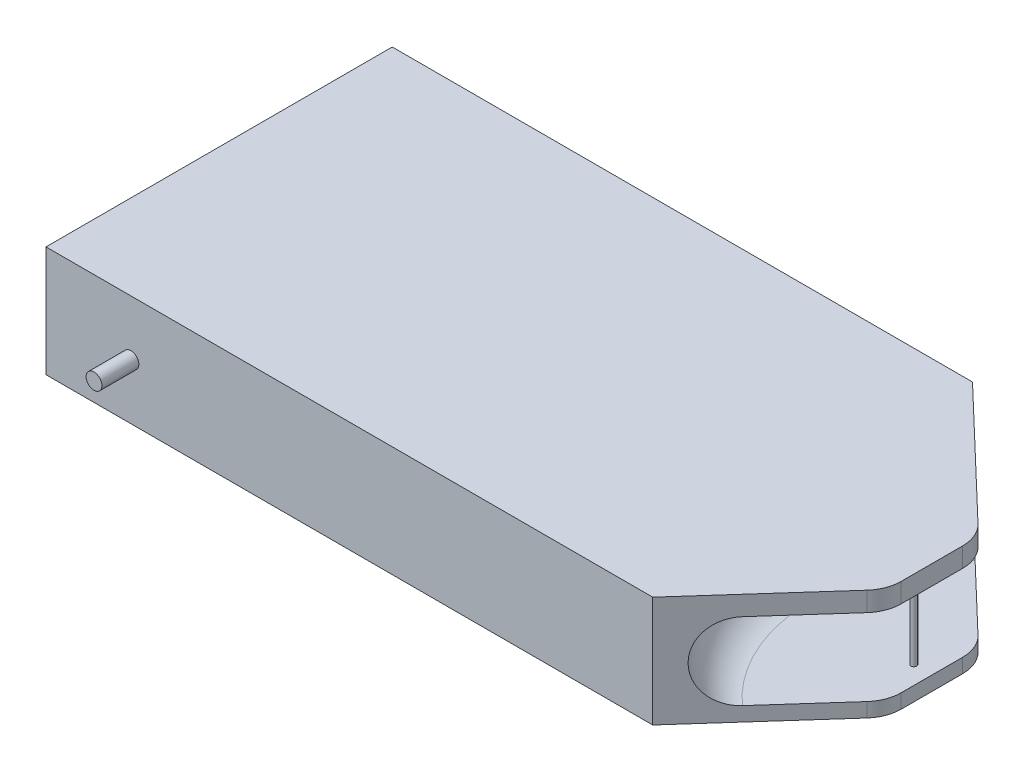
ISO-10303-21;
HEADER;
FILE_DESCRIPTION(('STEP AP214'),'2;1');
FILE_NAME('part.step','',(''),(''),'','','');
FILE_SCHEMA(('AUTOMOTIVE_DESIGN { 1 0 10303 214 1 1 1 1 }'));
ENDSEC;
DATA;
#1=APPLICATION_CONTEXT('core data for automotive mechanical design processes');
#2=APPLICATION_PROTOCOL_DEFINITION('international standard','automotive_design',2000,#1);
#3=PRODUCT_CONTEXT('',#1,'mechanical');
#4=PRODUCT('Part','Part','',(#3));
#5=PRODUCT_RELATED_PRODUCT_CATEGORY('part','',(#4));
#6=PRODUCT_DEFINITION_FORMATION('','',#4);
#7=PRODUCT_DEFINITION_CONTEXT('part definition',#1,'design');
#8=PRODUCT_DEFINITION('design','',#6,#7);
#9=PRODUCT_DEFINITION_SHAPE('','',#8);
#10=(LENGTH_UNIT() NAMED_UNIT(*) SI_UNIT(.MILLI.,.METRE.));
#11=(NAMED_UNIT(*) PLANE_ANGLE_UNIT() SI_UNIT($,.RADIAN.));
#12=(NAMED_UNIT(*) SI_UNIT($,.STERADIAN.) SOLID_ANGLE_UNIT());
#13=UNCERTAINTY_MEASURE_WITH_UNIT(LENGTH_MEASURE(1.E-05),#10,'distance_accuracy_value','');
#14=(GEOMETRIC_REPRESENTATION_CONTEXT(3) GLOBAL_UNCERTAINTY_ASSIGNED_CONTEXT((#13)) GLOBAL_UNIT_ASSIGNED_CONTEXT((#10,
#11,#12)) REPRESENTATION_CONTEXT('',''));
#15=CARTESIAN_POINT('',(0.,0.,0.));
#16=DIRECTION('',(0.,0.,1.));
#17=DIRECTION('',(1.,0.,0.));
#18=AXIS2_PLACEMENT_3D('',#15,#16,#17);
#19=CARTESIAN_POINT('',(76.8880220697445,30.,-39.4481456514547));
#20=DIRECTION('',(0.,0.,1.));
#21=DIRECTION('',(1.,0.,0.));
#22=AXIS2_PLACEMENT_3D('',#19,#20,#21);
#23=PLANE('',#22);
#24=CARTESIAN_POINT('',(-57.3213212292104,15.,-39.4481456514547));
#25=DIRECTION('',(0.,0.,1.));
#26=DIRECTION('',(1.,0.,0.));
#27=AXIS2_PLACEMENT_3D('',#24,#25,#26);
#28=CIRCLE('',#27,2.14624494855047);
#29=CARTESIAN_POINT('',(-55.1750762806599,15.,-39.4481456514547));
#30=VERTEX_POINT('',#29);
#31=EDGE_CURVE('E217',#30,#30,#28,.T.);
#32=ORIENTED_EDGE('',*,*,#31,.T.);
#33=EDGE_LOOP('',(#32));
#34=FACE_BOUND('',#33,.T.);
#35=DIRECTION('',(-1.,0.,0.));
#36=VECTOR('',#35,1.);
#37=CARTESIAN_POINT('',(76.8880220697445,0.,-39.4481456514547));
#38=LINE('',#37,#36);
#39=CARTESIAN_POINT('',(76.8880220697445,0.,-39.4481456514547));
#40=VERTEX_POINT('',#39);
#41=CARTESIAN_POINT('',(-80.3307693265987,0.,-39.4481456514547));
#42=VERTEX_POINT('',#41);
#43=EDGE_CURVE('E234',#40,#42,#38,.T.);
#44=ORIENTED_EDGE('',*,*,#43,.T.);
#45=DIRECTION('',(0.,-1.,0.));
#46=VECTOR('',#45,1.);
#47=CARTESIAN_POINT('',(-80.3307693265987,30.,-39.4481456514547));
#48=LINE('',#47,#46);
#49=CARTESIAN_POINT('',(-80.3307693265987,30.,-39.4481456514547));
#50=VERTEX_POINT('',#49);
#51=EDGE_CURVE('E267',#50,#42,#48,.T.);
#52=ORIENTED_EDGE('',*,*,#51,.F.);
#53=DIRECTION('',(-1.,0.,0.));
#54=VECTOR('',#53,1.);
#55=CARTESIAN_POINT('',(76.8880220697445,30.,-39.4481456514547));
#56=LINE('',#55,#54);
#57=CARTESIAN_POINT('',(76.8880220697445,30.,-39.4481456514547));
#58=VERTEX_POINT('',#57);
#59=EDGE_CURVE('E235',#58,#50,#56,.T.);
#60=ORIENTED_EDGE('',*,*,#59,.F.);
#61=DIRECTION('',(0.,-1.,0.));
#62=VECTOR('',#61,1.);
#63=CARTESIAN_POINT('',(76.8880220697445,30.,-39.4481456514547));
#64=LINE('',#63,#62);
#65=EDGE_CURVE('E248',#58,#40,#64,.T.);
#66=ORIENTED_EDGE('',*,*,#65,.T.);
#67=EDGE_LOOP('',(#44,#52,#60,#66));
#68=FACE_BOUND('',#67,.T.);
#69=ADVANCED_FACE('F33',(#34,#68),#23,.F.);
#70=CARTESIAN_POINT('',(-80.3307693265987,30.,-39.4481456514547));
#71=DIRECTION('',(1.,0.,0.));
#72=DIRECTION('',(0.,0.,-1.));
#73=AXIS2_PLACEMENT_3D('',#70,#71,#72);
#74=PLANE('',#73);
#75=DIRECTION('',(0.,0.,-1.));
#76=VECTOR('',#75,1.);
#77=CARTESIAN_POINT('',(-80.3307693265987,27.9510715241033,-36.7072827771247));
#78=LINE('',#77,#76);
#79=CARTESIAN_POINT('',(-80.3307693265987,27.9510715241033,51.6258542234931));
#80=VERTEX_POINT('',#79);
#81=CARTESIAN_POINT('',(-80.3307693265987,27.9510715241033,-36.7072827771247));
#82=VERTEX_POINT('',#81);
#83=EDGE_CURVE('E189',#80,#82,#78,.T.);
#84=ORIENTED_EDGE('',*,*,#83,.F.);
#85=DIRECTION('',(0.,1.,0.));
#86=VECTOR('',#85,1.);
#87=CARTESIAN_POINT('',(-80.3307693265987,27.9510715241033,51.6258542234931));
#88=LINE('',#87,#86);
#89=CARTESIAN_POINT('',(-80.3307693265987,2.04892847589666,51.6258542234931));
#90=VERTEX_POINT('',#89);
#91=EDGE_CURVE('E48',#90,#80,#88,.T.);
#92=ORIENTED_EDGE('',*,*,#91,.F.);
#93=DIRECTION('',(0.,0.,1.));
#94=VECTOR('',#93,1.);
#95=CARTESIAN_POINT('',(-80.3307693265987,2.04892847589666,-36.7072827771247));
#96=LINE('',#95,#94);
#97=CARTESIAN_POINT('',(-80.3307693265987,2.04892847589666,-36.7072827771247));
#98=VERTEX_POINT('',#97);
#99=EDGE_CURVE('E180',#98,#90,#96,.T.);
#100=ORIENTED_EDGE('',*,*,#99,.F.);
#101=DIRECTION('',(0.,-1.,0.));
#102=VECTOR('',#101,1.);
#103=CARTESIAN_POINT('',(-80.3307693265987,27.9510715241033,-36.7072827771247));
#104=LINE('',#103,#102);
#105=EDGE_CURVE('E183',#82,#98,#104,.T.);
#106=ORIENTED_EDGE('',*,*,#105,.F.);
#107=EDGE_LOOP('',(#84,#92,#100,#106));
#108=FACE_BOUND('',#107,.T.);
#109=DIRECTION('',(0.,0.,1.));
#110=VECTOR('',#109,1.);
#111=CARTESIAN_POINT('',(-80.3307693265987,0.,-39.4481456514547));
#112=LINE('',#111,#110);
#113=CARTESIAN_POINT('',(-80.3307693265987,0.,54.3667170978231));
#114=VERTEX_POINT('',#113);
#115=EDGE_CURVE('E251',#42,#114,#112,.T.);
#116=ORIENTED_EDGE('',*,*,#115,.T.);
#117=DIRECTION('',(0.,-1.,0.));
#118=VECTOR('',#117,1.);
#119=CARTESIAN_POINT('',(-80.3307693265987,30.,54.3667170978231));
#120=LINE('',#119,#118);
#121=CARTESIAN_POINT('',(-80.3307693265987,30.,54.3667170978231));
#122=VERTEX_POINT('',#121);
#123=EDGE_CURVE('E264',#122,#114,#120,.T.);
#124=ORIENTED_EDGE('',*,*,#123,.F.);
#125=DIRECTION('',(0.,0.,1.));
#126=VECTOR('',#125,1.);
#127=CARTESIAN_POINT('',(-80.3307693265987,30.,-39.4481456514547));
#128=LINE('',#127,#126);
#129=EDGE_CURVE('E238',#50,#122,#128,.T.);
#130=ORIENTED_EDGE('',*,*,#129,.F.);
#131=ORIENTED_EDGE('',*,*,#51,.T.);
#132=EDGE_LOOP('',(#116,#124,#130,#131));
#133=FACE_BOUND('',#132,.T.);
#134=ADVANCED_FACE('F331',(#108,#133),#74,.F.);
#135=CARTESIAN_POINT('',(-80.3307693265987,30.,54.3667170978231));
#136=DIRECTION('',(0.,0.,-1.));
#137=DIRECTION('',(-1.,0.,0.));
#138=AXIS2_PLACEMENT_3D('',#135,#136,#137);
#139=PLANE('',#138);
#140=CARTESIAN_POINT('',(-57.3213212292104,15.,54.3667170978231));
#141=DIRECTION('',(0.,0.,-1.));
#142=DIRECTION('',(-1.,0.,0.));
#143=AXIS2_PLACEMENT_3D('',#140,#141,#142);
#144=CIRCLE('',#143,2.14624494855047);
#145=CARTESIAN_POINT('',(-59.4675661777609,15.,54.3667170978231));
#146=VERTEX_POINT('',#145);
#147=EDGE_CURVE('E216',#146,#146,#144,.T.);
#148=ORIENTED_EDGE('',*,*,#147,.T.);
#149=EDGE_LOOP('',(#148));
#150=FACE_BOUND('',#149,.T.);
#151=DIRECTION('',(1.,0.,0.));
#152=VECTOR('',#151,1.);
#153=CARTESIAN_POINT('',(-80.3307693265987,0.,54.3667170978231));
#154=LINE('',#153,#152);
#155=CARTESIAN_POINT('',(84.0604121881908,0.,54.3667170978231));
#156=VERTEX_POINT('',#155);
#157=EDGE_CURVE('E253',#114,#156,#154,.T.);
#158=ORIENTED_EDGE('',*,*,#157,.T.);
#159=DIRECTION('',(0.,-1.,0.));
#160=VECTOR('',#159,1.);
#161=CARTESIAN_POINT('',(84.0604121881908,30.,54.3667170978231));
#162=LINE('',#161,#160);
#163=CARTESIAN_POINT('',(84.0604121881908,30.,54.3667170978231));
#164=VERTEX_POINT('',#163);
#165=EDGE_CURVE('E261',#164,#156,#162,.T.);
#166=ORIENTED_EDGE('',*,*,#165,.F.);
#167=DIRECTION('',(1.,0.,0.));
#168=VECTOR('',#167,1.);
#169=CARTESIAN_POINT('',(-80.3307693265987,30.,54.3667170978231));
#170=LINE('',#169,#168);
#171=EDGE_CURVE('E241',#122,#164,#170,.T.);
#172=ORIENTED_EDGE('',*,*,#171,.F.);
#173=ORIENTED_EDGE('',*,*,#123,.T.);
#174=EDGE_LOOP('',(#158,#166,#172,#173));
#175=FACE_BOUND('',#174,.T.);
#176=ADVANCED_FACE('F350',(#150,#175),#139,.F.);
#177=CARTESIAN_POINT('',(84.0604121881908,30.,54.3667170978231));
#178=DIRECTION('',(-0.745897187729908,0.,-0.666061097300101));
#179=DIRECTION('',(-0.666061097300101,0.,0.745897187729908));
#180=AXIS2_PLACEMENT_3D('',#177,#178,#179);
#181=PLANE('',#180);
#182=DIRECTION('',(0.666061097300101,0.,-0.745897187729908));
#183=VECTOR('',#182,1.);
#184=CARTESIAN_POINT('',(84.0604121881908,0.,54.3667170978231));
#185=LINE('',#184,#183);
#186=CARTESIAN_POINT('',(111.475842603277,0.,23.6651905713395));
#187=VERTEX_POINT('',#186);
#188=EDGE_CURVE('E255',#156,#187,#185,.T.);
#189=ORIENTED_EDGE('',*,*,#188,.T.);
#190=DIRECTION('',(0.,1.,0.));
#191=VECTOR('',#190,1.);
#192=CARTESIAN_POINT('',(111.475842603277,30.,23.6651905713395));
#193=LINE('',#192,#191);
#194=CARTESIAN_POINT('',(111.475842603277,3.86617383164835,23.6651905713395));
#195=VERTEX_POINT('',#194);
#196=EDGE_CURVE('E285',#187,#195,#193,.T.);
#197=ORIENTED_EDGE('',*,*,#196,.T.);
#198=DIRECTION('',(-0.666061097300101,0.,0.745897187729908));
#199=VECTOR('',#198,1.);
#200=CARTESIAN_POINT('',(84.0604121881908,3.86617383164835,54.3667170978231));
#201=LINE('',#200,#199);
#202=CARTESIAN_POINT('',(95.5232040556325,3.86617383164835,41.5299604517497));
#203=VERTEX_POINT('',#202);
#204=EDGE_CURVE('E229',#195,#203,#201,.T.);
#205=ORIENTED_EDGE('',*,*,#204,.T.);
#206=CARTESIAN_POINT('',(95.5232040556325,14.2956715631222,41.5299604517497));
#207=DIRECTION('',(-0.745897187729908,0.,-0.666061097300101));
#208=DIRECTION('',(-0.666061097300101,0.,0.745897187729908));
#209=AXIS2_PLACEMENT_3D('',#206,#207,#208);
#210=CIRCLE('',#209,10.4294977314739);
#211=CARTESIAN_POINT('',(95.5232040556325,24.7251692945961,41.5299604517497));
#212=VERTEX_POINT('',#211);
#213=EDGE_CURVE('E231',#203,#212,#210,.T.);
#214=ORIENTED_EDGE('',*,*,#213,.T.);
#215=DIRECTION('',(0.666061097300101,0.,-0.745897187729908));
#216=VECTOR('',#215,1.);
#217=CARTESIAN_POINT('',(84.0604121881908,24.7251692945961,54.3667170978231));
#218=LINE('',#217,#216);
#219=CARTESIAN_POINT('',(111.475842603277,24.7251692945961,23.6651905713395));
#220=VERTEX_POINT('',#219);
#221=EDGE_CURVE('E226',#212,#220,#218,.T.);
#222=ORIENTED_EDGE('',*,*,#221,.T.);
#223=DIRECTION('',(0.,1.,0.));
#224=VECTOR('',#223,1.);
#225=CARTESIAN_POINT('',(111.475842603277,30.,23.6651905713395));
#226=LINE('',#225,#224);
#227=CARTESIAN_POINT('',(111.475842603277,30.,23.6651905713395));
#228=VERTEX_POINT('',#227);
#229=EDGE_CURVE('E282',#220,#228,#226,.T.);
#230=ORIENTED_EDGE('',*,*,#229,.T.);
#231=DIRECTION('',(0.666061097300101,0.,-0.745897187729908));
#232=VECTOR('',#231,1.);
#233=CARTESIAN_POINT('',(84.0604121881908,30.,54.3667170978231));
#234=LINE('',#233,#232);
#235=EDGE_CURVE('E243',#164,#228,#234,.T.);
#236=ORIENTED_EDGE('',*,*,#235,.F.);
#237=ORIENTED_EDGE('',*,*,#165,.T.);
#238=EDGE_LOOP('',(#189,#197,#205,#214,#222,#230,#236,#237));
#239=FACE_BOUND('',#238,.T.);
#240=ADVANCED_FACE('F386',(#239),#181,.F.);
#241=CARTESIAN_POINT('',(125.947170479917,30.,7.45928572318418));
#242=DIRECTION('',(-0.691078679694519,0.,0.72277953656124));
#243=DIRECTION('',(0.72277953656124,0.,0.691078679694519));
#244=AXIS2_PLACEMENT_3D('',#241,#242,#243);
#245=PLANE('',#244);
#246=DIRECTION('',(0.72277953656124,0.,0.691078679694519));
#247=VECTOR('',#246,1.);
#248=CARTESIAN_POINT('',(125.947170479917,3.86617383164835,7.45928572318418));
#249=LINE('',#248,#247);
#250=CARTESIAN_POINT('',(92.9324508969305,3.86617383164835,-24.1074198430049));
#251=VERTEX_POINT('',#250);
#252=CARTESIAN_POINT('',(110.927657522923,3.86617383164835,-6.90147666552068));
#253=VERTEX_POINT('',#252);
#254=EDGE_CURVE('E272',#251,#253,#249,.T.);
#255=ORIENTED_EDGE('',*,*,#254,.T.);
#256=DIRECTION('',(0.,1.,0.));
#257=VECTOR('',#256,1.);
#258=CARTESIAN_POINT('',(110.927657522923,30.,-6.90147666552068));
#259=LINE('',#258,#257);
#260=CARTESIAN_POINT('',(110.927657522923,0.,-6.90147666552068));
#261=VERTEX_POINT('',#260);
#262=EDGE_CURVE('E303',#253,#261,#259,.F.);
#263=ORIENTED_EDGE('',*,*,#262,.T.);
#264=DIRECTION('',(-0.72277953656124,0.,-0.691078679694519));
#265=VECTOR('',#264,1.);
#266=CARTESIAN_POINT('',(125.947170479917,0.,7.45928572318418));
#267=LINE('',#266,#265);
#268=EDGE_CURVE('E239',#261,#40,#267,.T.);
#269=ORIENTED_EDGE('',*,*,#268,.T.);
#270=ORIENTED_EDGE('',*,*,#65,.F.);
#271=DIRECTION('',(-0.72277953656124,0.,-0.691078679694519));
#272=VECTOR('',#271,1.);
#273=CARTESIAN_POINT('',(125.947170479917,30.,7.45928572318418));
#274=LINE('',#273,#272);
#275=CARTESIAN_POINT('',(110.927657522923,30.,-6.90147666552068));
#276=VERTEX_POINT('',#275);
#277=EDGE_CURVE('E246',#276,#58,#274,.T.);
#278=ORIENTED_EDGE('',*,*,#277,.F.);
#279=DIRECTION('',(0.,1.,0.));
#280=VECTOR('',#279,1.);
#281=CARTESIAN_POINT('',(110.927657522923,30.,-6.90147666552068));
#282=LINE('',#281,#280);
#283=CARTESIAN_POINT('',(110.927657522923,24.7251692945961,-6.90147666552068));
#284=VERTEX_POINT('',#283);
#285=EDGE_CURVE('E301',#276,#284,#282,.F.);
#286=ORIENTED_EDGE('',*,*,#285,.T.);
#287=DIRECTION('',(-0.72277953656124,0.,-0.691078679694519));
#288=VECTOR('',#287,1.);
#289=CARTESIAN_POINT('',(125.947170479917,24.7251692945961,7.45928572318418));
#290=LINE('',#289,#288);
#291=CARTESIAN_POINT('',(92.9324508969305,24.7251692945961,-24.1074198430049));
#292=VERTEX_POINT('',#291);
#293=EDGE_CURVE('E270',#284,#292,#290,.T.);
#294=ORIENTED_EDGE('',*,*,#293,.T.);
#295=CARTESIAN_POINT('',(92.9324508969305,14.2956715631222,-24.1074198430049));
#296=DIRECTION('',(-0.691078679694519,0.,0.72277953656124));
#297=DIRECTION('',(0.72277953656124,0.,0.691078679694519));
#298=AXIS2_PLACEMENT_3D('',#295,#296,#297);
#299=CIRCLE('',#298,10.4294977314739);
#300=EDGE_CURVE('E275',#292,#251,#299,.T.);
#301=ORIENTED_EDGE('',*,*,#300,.T.);
#302=EDGE_LOOP('',(#255,#263,#269,#270,#278,#286,#294,#301));
#303=FACE_BOUND('',#302,.T.);
#304=ADVANCED_FACE('F393',(#303),#245,.F.);
#305=CARTESIAN_POINT('',(0.,30.,0.));
#306=DIRECTION('',(0.,1.,0.));
#307=DIRECTION('',(0.,0.,1.));
#308=AXIS2_PLACEMENT_3D('',#305,#306,#307);
#309=PLANE('',#308);
#310=DIRECTION('',(0.,0.,1.));
#311=VECTOR('',#310,1.);
#312=CARTESIAN_POINT('',(114.016870725978,30.,-3.94775526961741));
#313=LINE('',#312,#311);
#314=CARTESIAN_POINT('',(114.016870725978,30.,0.326318700091716));
#315=VERTEX_POINT('',#314);
#316=CARTESIAN_POINT('',(114.016870725978,30.,17.0045795983385));
#317=VERTEX_POINT('',#316);
#318=EDGE_CURVE('E202',#315,#317,#313,.T.);
#319=ORIENTED_EDGE('',*,*,#318,.F.);
#320=CARTESIAN_POINT('',(104.016870725978,30.,0.326318700091716));
#321=DIRECTION('',(0.,1.,0.));
#322=DIRECTION('',(0.,0.,1.));
#323=AXIS2_PLACEMENT_3D('',#320,#321,#322);
#324=CIRCLE('',#323,10.);
#325=EDGE_CURVE('E311',#315,#276,#324,.T.);
#326=ORIENTED_EDGE('',*,*,#325,.T.);
#327=ORIENTED_EDGE('',*,*,#277,.T.);
#328=ORIENTED_EDGE('',*,*,#59,.T.);
#329=ORIENTED_EDGE('',*,*,#129,.T.);
#330=ORIENTED_EDGE('',*,*,#171,.T.);
#331=ORIENTED_EDGE('',*,*,#235,.T.);
#332=CARTESIAN_POINT('',(104.016870725978,30.,17.0045795983385));
#333=DIRECTION('',(0.,1.,0.));
#334=DIRECTION('',(0.,0.,1.));
#335=AXIS2_PLACEMENT_3D('',#332,#333,#334);
#336=CIRCLE('',#335,10.);
#337=EDGE_CURVE('E309',#228,#317,#336,.T.);
#338=ORIENTED_EDGE('',*,*,#337,.T.);
#339=EDGE_LOOP('',(#319,#326,#327,#328,#329,#330,#331,#338));
#340=FACE_BOUND('',#339,.T.);
#341=ADVANCED_FACE('F381',(#340),#309,.T.);
#342=CARTESIAN_POINT('',(0.,0.,0.));
#343=DIRECTION('',(0.,1.,0.));
#344=DIRECTION('',(0.,0.,1.));
#345=AXIS2_PLACEMENT_3D('',#342,#343,#344);
#346=PLANE('',#345);
#347=DIRECTION('',(0.,0.,1.));
#348=VECTOR('',#347,1.);
#349=CARTESIAN_POINT('',(114.016870725978,0.,-3.94775526961741));
#350=LINE('',#349,#348);
#351=CARTESIAN_POINT('',(114.016870725978,0.,0.326318700091716));
#352=VERTEX_POINT('',#351);
#353=CARTESIAN_POINT('',(114.016870725978,0.,17.0045795983385));
#354=VERTEX_POINT('',#353);
#355=EDGE_CURVE('E203',#352,#354,#350,.T.);
#356=ORIENTED_EDGE('',*,*,#355,.T.);
#357=CARTESIAN_POINT('',(104.016870725978,0.,17.0045795983385));
#358=DIRECTION('',(0.,1.,0.));
#359=DIRECTION('',(0.,0.,1.));
#360=AXIS2_PLACEMENT_3D('',#357,#358,#359);
#361=CIRCLE('',#360,10.);
#362=EDGE_CURVE('E299',#354,#187,#361,.F.);
#363=ORIENTED_EDGE('',*,*,#362,.T.);
#364=ORIENTED_EDGE('',*,*,#188,.F.);
#365=ORIENTED_EDGE('',*,*,#157,.F.);
#366=ORIENTED_EDGE('',*,*,#115,.F.);
#367=ORIENTED_EDGE('',*,*,#43,.F.);
#368=ORIENTED_EDGE('',*,*,#268,.F.);
#369=CARTESIAN_POINT('',(104.016870725978,0.,0.326318700091716));
#370=DIRECTION('',(0.,1.,0.));
#371=DIRECTION('',(0.,0.,1.));
#372=AXIS2_PLACEMENT_3D('',#369,#370,#371);
#373=CIRCLE('',#372,10.);
#374=EDGE_CURVE('E297',#261,#352,#373,.F.);
#375=ORIENTED_EDGE('',*,*,#374,.T.);
#376=EDGE_LOOP('',(#356,#363,#364,#365,#366,#367,#368,#375));
#377=FACE_BOUND('',#376,.T.);
#378=ADVANCED_FACE('F407',(#377),#346,.F.);
#379=CARTESIAN_POINT('',(125.947170479917,14.2956715631222,7.45928572318418));
#380=DIRECTION('',(0.,1.,0.));
#381=DIRECTION('',(0.,0.,1.));
#382=AXIS2_PLACEMENT_3D('',#379,#380,#381);
#383=TOROIDAL_SURFACE('',#382,45.677440924878,10.4294977314739);
#384=CARTESIAN_POINT('',(125.947170479917,3.86617383164835,7.45928572318418));
#385=DIRECTION('',(0.,1.,0.));
#386=DIRECTION('',(0.,0.,1.));
#387=AXIS2_PLACEMENT_3D('',#384,#385,#386);
#388=CIRCLE('',#387,45.677440924878);
#389=EDGE_CURVE('E223',#251,#203,#388,.T.);
#390=ORIENTED_EDGE('',*,*,#389,.F.);
#391=ORIENTED_EDGE('',*,*,#300,.F.);
#392=CARTESIAN_POINT('',(125.947170479917,24.7251692945961,7.45928572318418));
#393=DIRECTION('',(0.,1.,0.));
#394=DIRECTION('',(0.,0.,1.));
#395=AXIS2_PLACEMENT_3D('',#392,#393,#394);
#396=CIRCLE('',#395,45.677440924878);
#397=EDGE_CURVE('E220',#292,#212,#396,.T.);
#398=ORIENTED_EDGE('',*,*,#397,.T.);
#399=ORIENTED_EDGE('',*,*,#213,.F.);
#400=EDGE_LOOP('',(#390,#391,#398,#399));
#401=FACE_BOUND('',#400,.T.);
#402=ADVANCED_FACE('F391',(#401),#383,.F.);
#403=CARTESIAN_POINT('',(95.5232040556325,3.86617383164835,41.5299604517497));
#404=DIRECTION('',(0.,-1.,0.));
#405=DIRECTION('',(0.,0.,-1.));
#406=AXIS2_PLACEMENT_3D('',#403,#404,#405);
#407=PLANE('',#406);
#408=CARTESIAN_POINT('',(109.099187599402,3.86617383164835,8.66544914921508));
#409=DIRECTION('',(0.,-1.,0.));
#410=DIRECTION('',(0.,0.,-1.));
#411=AXIS2_PLACEMENT_3D('',#408,#409,#410);
#412=CIRCLE('',#411,0.76292283975943);
#413=CARTESIAN_POINT('',(109.099187599402,3.86617383164835,7.90252630945565));
#414=VERTEX_POINT('',#413);
#415=EDGE_CURVE('E199',#414,#414,#412,.T.);
#416=ORIENTED_EDGE('',*,*,#415,.T.);
#417=EDGE_LOOP('',(#416));
#418=FACE_BOUND('',#417,.T.);
#419=ORIENTED_EDGE('',*,*,#204,.F.);
#420=CARTESIAN_POINT('',(104.016870725978,3.86617383164835,17.0045795983385));
#421=DIRECTION('',(0.,-1.,0.));
#422=DIRECTION('',(0.,0.,-1.));
#423=AXIS2_PLACEMENT_3D('',#420,#421,#422);
#424=CIRCLE('',#423,10.);
#425=CARTESIAN_POINT('',(114.016870725978,3.86617383164835,17.0045795983385));
#426=VERTEX_POINT('',#425);
#427=EDGE_CURVE('E290',#195,#426,#424,.F.);
#428=ORIENTED_EDGE('',*,*,#427,.T.);
#429=DIRECTION('',(0.,0.,-1.));
#430=VECTOR('',#429,1.);
#431=CARTESIAN_POINT('',(114.016870725978,3.86617383164835,41.5299604517497));
#432=LINE('',#431,#430);
#433=CARTESIAN_POINT('',(114.016870725978,3.86617383164835,0.32631870009172));
#434=VERTEX_POINT('',#433);
#435=EDGE_CURVE('E206',#426,#434,#432,.T.);
#436=ORIENTED_EDGE('',*,*,#435,.T.);
#437=CARTESIAN_POINT('',(104.016870725978,3.86617383164835,0.326318700091716));
#438=DIRECTION('',(0.,-1.,0.));
#439=DIRECTION('',(0.,0.,-1.));
#440=AXIS2_PLACEMENT_3D('',#437,#438,#439);
#441=CIRCLE('',#440,10.);
#442=EDGE_CURVE('E288',#434,#253,#441,.F.);
#443=ORIENTED_EDGE('',*,*,#442,.T.);
#444=ORIENTED_EDGE('',*,*,#254,.F.);
#445=ORIENTED_EDGE('',*,*,#389,.T.);
#446=EDGE_LOOP('',(#419,#428,#436,#443,#444,#445));
#447=FACE_BOUND('',#446,.T.);
#448=ADVANCED_FACE('F413',(#418,#447),#407,.F.);
#449=CARTESIAN_POINT('',(95.5232040556325,24.7251692945961,41.5299604517497));
#450=DIRECTION('',(0.,1.,0.));
#451=DIRECTION('',(0.,0.,1.));
#452=AXIS2_PLACEMENT_3D('',#449,#450,#451);
#453=PLANE('',#452);
#454=CARTESIAN_POINT('',(109.099187599402,24.7251692945961,8.66544914921508));
#455=DIRECTION('',(0.,1.,0.));
#456=DIRECTION('',(0.,0.,1.));
#457=AXIS2_PLACEMENT_3D('',#454,#455,#456);
#458=CIRCLE('',#457,0.76292283975943);
#459=CARTESIAN_POINT('',(109.099187599402,24.7251692945961,9.42837198897452));
#460=VERTEX_POINT('',#459);
#461=EDGE_CURVE('E195',#460,#460,#458,.T.);
#462=ORIENTED_EDGE('',*,*,#461,.T.);
#463=EDGE_LOOP('',(#462));
#464=FACE_BOUND('',#463,.T.);
#465=ORIENTED_EDGE('',*,*,#293,.F.);
#466=CARTESIAN_POINT('',(104.016870725978,24.7251692945961,0.326318700091716));
#467=DIRECTION('',(0.,1.,0.));
#468=DIRECTION('',(0.,0.,1.));
#469=AXIS2_PLACEMENT_3D('',#466,#467,#468);
#470=CIRCLE('',#469,10.);
#471=CARTESIAN_POINT('',(114.016870725978,24.7251692945961,0.32631870009172));
#472=VERTEX_POINT('',#471);
#473=EDGE_CURVE('E315',#284,#472,#470,.F.);
#474=ORIENTED_EDGE('',*,*,#473,.T.);
#475=DIRECTION('',(0.,0.,1.));
#476=VECTOR('',#475,1.);
#477=CARTESIAN_POINT('',(114.016870725978,24.7251692945961,41.5299604517497));
#478=LINE('',#477,#476);
#479=CARTESIAN_POINT('',(114.016870725978,24.7251692945961,17.0045795983385));
#480=VERTEX_POINT('',#479);
#481=EDGE_CURVE('E278',#472,#480,#478,.T.);
#482=ORIENTED_EDGE('',*,*,#481,.T.);
#483=CARTESIAN_POINT('',(104.016870725978,24.7251692945961,17.0045795983385));
#484=DIRECTION('',(0.,1.,0.));
#485=DIRECTION('',(0.,0.,1.));
#486=AXIS2_PLACEMENT_3D('',#483,#484,#485);
#487=CIRCLE('',#486,10.);
#488=EDGE_CURVE('E313',#480,#220,#487,.F.);
#489=ORIENTED_EDGE('',*,*,#488,.T.);
#490=ORIENTED_EDGE('',*,*,#221,.F.);
#491=ORIENTED_EDGE('',*,*,#397,.F.);
#492=EDGE_LOOP('',(#465,#474,#482,#489,#490,#491));
#493=FACE_BOUND('',#492,.T.);
#494=ADVANCED_FACE('F375',(#464,#493),#453,.F.);
#495=CARTESIAN_POINT('',(-57.3213212292104,15.,64.3667170978231));
#496=DIRECTION('',(0.,0.,1.));
#497=DIRECTION('',(1.,0.,0.));
#498=AXIS2_PLACEMENT_3D('',#495,#496,#497);
#499=PLANE('',#498);
#500=CARTESIAN_POINT('',(-57.3213212292104,15.,64.3667170978231));
#501=DIRECTION('',(0.,0.,1.));
#502=DIRECTION('',(1.,0.,0.));
#503=AXIS2_PLACEMENT_3D('',#500,#501,#502);
#504=CIRCLE('',#503,2.14624494855047);
#505=CARTESIAN_POINT('',(-55.1750762806599,15.,64.3667170978231));
#506=VERTEX_POINT('',#505);
#507=EDGE_CURVE('E210',#506,#506,#504,.T.);
#508=ORIENTED_EDGE('',*,*,#507,.T.);
#509=EDGE_LOOP('',(#508));
#510=FACE_BOUND('',#509,.T.);
#511=ADVANCED_FACE('F426',(#510),#499,.T.);
#512=CARTESIAN_POINT('',(-57.3213212292104,15.,-49.6332829021769));
#513=DIRECTION('',(0.,0.,1.));
#514=DIRECTION('',(1.,0.,0.));
#515=AXIS2_PLACEMENT_3D('',#512,#513,#514);
#516=CYLINDRICAL_SURFACE('',#515,2.14624494855047);
#517=ORIENTED_EDGE('',*,*,#507,.F.);
#518=EDGE_LOOP('',(#517));
#519=FACE_BOUND('',#518,.T.);
#520=ORIENTED_EDGE('',*,*,#147,.F.);
#521=EDGE_LOOP('',(#520));
#522=FACE_BOUND('',#521,.T.);
#523=ADVANCED_FACE('F429',(#519,#522),#516,.T.);
#524=CARTESIAN_POINT('',(-57.3213212292104,15.,-49.6332829021769));
#525=DIRECTION('',(0.,0.,1.));
#526=DIRECTION('',(1.,0.,0.));
#527=AXIS2_PLACEMENT_3D('',#524,#525,#526);
#528=CIRCLE('',#527,2.14624494855047);
#529=CARTESIAN_POINT('',(-55.1750762806599,15.,-49.6332829021769));
#530=VERTEX_POINT('',#529);
#531=EDGE_CURVE('E213',#530,#530,#528,.T.);
#532=ORIENTED_EDGE('',*,*,#531,.T.);
#533=EDGE_LOOP('',(#532));
#534=FACE_BOUND('',#533,.T.);
#535=ORIENTED_EDGE('',*,*,#31,.F.);
#536=EDGE_LOOP('',(#535));
#537=FACE_BOUND('',#536,.T.);
#538=ADVANCED_FACE('F433',(#534,#537),#516,.T.);
#539=CARTESIAN_POINT('',(-57.3213212292104,15.,-49.6332829021769));
#540=DIRECTION('',(0.,0.,1.));
#541=DIRECTION('',(1.,0.,0.));
#542=AXIS2_PLACEMENT_3D('',#539,#540,#541);
#543=PLANE('',#542);
#544=ORIENTED_EDGE('',*,*,#531,.F.);
#545=EDGE_LOOP('',(#544));
#546=FACE_BOUND('',#545,.T.);
#547=ADVANCED_FACE('F423',(#546),#543,.F.);
#548=CARTESIAN_POINT('',(114.016870725978,0.,-3.94775526961741));
#549=DIRECTION('',(-1.,0.,0.));
#550=DIRECTION('',(0.,0.,1.));
#551=AXIS2_PLACEMENT_3D('',#548,#549,#550);
#552=PLANE('',#551);
#553=ORIENTED_EDGE('',*,*,#481,.F.);
#554=DIRECTION('',(0.,1.,0.));
#555=VECTOR('',#554,1.);
#556=CARTESIAN_POINT('',(114.016870725978,0.,0.326318700091716));
#557=LINE('',#556,#555);
#558=EDGE_CURVE('E306',#472,#315,#557,.T.);
#559=ORIENTED_EDGE('',*,*,#558,.T.);
#560=ORIENTED_EDGE('',*,*,#318,.T.);
#561=DIRECTION('',(0.,1.,0.));
#562=VECTOR('',#561,1.);
#563=CARTESIAN_POINT('',(114.016870725978,0.,17.0045795983385));
#564=LINE('',#563,#562);
#565=EDGE_CURVE('E56',#317,#480,#564,.F.);
#566=ORIENTED_EDGE('',*,*,#565,.T.);
#567=EDGE_LOOP('',(#553,#559,#560,#566));
#568=FACE_BOUND('',#567,.T.);
#569=ADVANCED_FACE('F378',(#568),#552,.F.);
#570=ORIENTED_EDGE('',*,*,#435,.F.);
#571=DIRECTION('',(0.,1.,0.));
#572=VECTOR('',#571,1.);
#573=CARTESIAN_POINT('',(114.016870725978,0.,17.0045795983385));
#574=LINE('',#573,#572);
#575=EDGE_CURVE('E295',#426,#354,#574,.F.);
#576=ORIENTED_EDGE('',*,*,#575,.T.);
#577=ORIENTED_EDGE('',*,*,#355,.F.);
#578=DIRECTION('',(0.,1.,0.));
#579=VECTOR('',#578,1.);
#580=CARTESIAN_POINT('',(114.016870725978,0.,0.326318700091716));
#581=LINE('',#580,#579);
#582=EDGE_CURVE('E292',#352,#434,#581,.T.);
#583=ORIENTED_EDGE('',*,*,#582,.T.);
#584=EDGE_LOOP('',(#570,#576,#577,#583));
#585=FACE_BOUND('',#584,.T.);
#586=ADVANCED_FACE('F359',(#585),#552,.F.);
#587=CARTESIAN_POINT('',(104.016870725978,30.,17.0045795983385));
#588=DIRECTION('',(0.,1.,0.));
#589=DIRECTION('',(0.,0.,1.));
#590=AXIS2_PLACEMENT_3D('',#587,#588,#589);
#591=CYLINDRICAL_SURFACE('',#590,10.);
#592=ORIENTED_EDGE('',*,*,#362,.F.);
#593=ORIENTED_EDGE('',*,*,#575,.F.);
#594=ORIENTED_EDGE('',*,*,#427,.F.);
#595=ORIENTED_EDGE('',*,*,#196,.F.);
#596=EDGE_LOOP('',(#592,#593,#594,#595));
#597=FACE_BOUND('',#596,.T.);
#598=ADVANCED_FACE('F355',(#597),#591,.T.);
#599=CARTESIAN_POINT('',(104.016870725978,0.,0.326318700091716));
#600=DIRECTION('',(0.,1.,0.));
#601=DIRECTION('',(0.,0.,1.));
#602=AXIS2_PLACEMENT_3D('',#599,#600,#601);
#603=CYLINDRICAL_SURFACE('',#602,10.);
#604=ORIENTED_EDGE('',*,*,#374,.F.);
#605=ORIENTED_EDGE('',*,*,#262,.F.);
#606=ORIENTED_EDGE('',*,*,#442,.F.);
#607=ORIENTED_EDGE('',*,*,#582,.F.);
#608=EDGE_LOOP('',(#604,#605,#606,#607));
#609=FACE_BOUND('',#608,.T.);
#610=ADVANCED_FACE('F358',(#609),#603,.T.);
#611=CARTESIAN_POINT('',(104.016870725978,0.,0.326318700091716));
#612=DIRECTION('',(0.,1.,0.));
#613=DIRECTION('',(0.,0.,1.));
#614=AXIS2_PLACEMENT_3D('',#611,#612,#613);
#615=CYLINDRICAL_SURFACE('',#614,10.);
#616=ORIENTED_EDGE('',*,*,#473,.F.);
#617=ORIENTED_EDGE('',*,*,#285,.F.);
#618=ORIENTED_EDGE('',*,*,#325,.F.);
#619=ORIENTED_EDGE('',*,*,#558,.F.);
#620=EDGE_LOOP('',(#616,#617,#618,#619));
#621=FACE_BOUND('',#620,.T.);
#622=ADVANCED_FACE('F362',(#621),#615,.T.);
#623=CARTESIAN_POINT('',(104.016870725978,30.,17.0045795983385));
#624=DIRECTION('',(0.,1.,0.));
#625=DIRECTION('',(0.,0.,1.));
#626=AXIS2_PLACEMENT_3D('',#623,#624,#625);
#627=CYLINDRICAL_SURFACE('',#626,10.);
#628=ORIENTED_EDGE('',*,*,#488,.F.);
#629=ORIENTED_EDGE('',*,*,#565,.F.);
#630=ORIENTED_EDGE('',*,*,#337,.F.);
#631=ORIENTED_EDGE('',*,*,#229,.F.);
#632=EDGE_LOOP('',(#628,#629,#630,#631));
#633=FACE_BOUND('',#632,.T.);
#634=ADVANCED_FACE('F35',(#633),#627,.T.);
#635=CARTESIAN_POINT('',(109.099187599402,0.,8.66544914921508));
#636=DIRECTION('',(0.,1.,0.));
#637=DIRECTION('',(0.,0.,1.));
#638=AXIS2_PLACEMENT_3D('',#635,#636,#637);
#639=CYLINDRICAL_SURFACE('',#638,0.76292283975943);
#640=ORIENTED_EDGE('',*,*,#461,.F.);
#641=EDGE_LOOP('',(#640));
#642=FACE_BOUND('',#641,.T.);
#643=ORIENTED_EDGE('',*,*,#415,.F.);
#644=EDGE_LOOP('',(#643));
#645=FACE_BOUND('',#644,.T.);
#646=ADVANCED_FACE('F339',(#642,#645),#639,.T.);
#647=CARTESIAN_POINT('',(-75.3307693265987,27.9510715241033,51.6258542234931));
#648=DIRECTION('',(0.,0.,1.));
#649=DIRECTION('',(1.,0.,0.));
#650=AXIS2_PLACEMENT_3D('',#647,#648,#649);
#651=PLANE('',#650);
#652=CARTESIAN_POINT('',(-79.909462448226,27.1764345100368,51.6258542234931));
#653=DIRECTION('',(0.,0.,1.));
#654=DIRECTION('',(1.,0.,0.));
#655=AXIS2_PLACEMENT_3D('',#652,#653,#654);
#656=CIRCLE('',#655,0.25);
#657=CARTESIAN_POINT('',(-79.659462448226,27.1764345100368,51.6258542234931));
#658=VERTEX_POINT('',#657);
#659=EDGE_CURVE('E11',#658,#658,#656,.F.);
#660=ORIENTED_EDGE('',*,*,#659,.F.);
#661=EDGE_LOOP('',(#660));
#662=FACE_BOUND('',#661,.T.);
#663=ORIENTED_EDGE('',*,*,#91,.T.);
#664=DIRECTION('',(-1.,0.,0.));
#665=VECTOR('',#664,1.);
#666=CARTESIAN_POINT('',(-75.3307693265987,27.9510715241033,51.6258542234931));
#667=LINE('',#666,#665);
#668=CARTESIAN_POINT('',(-75.3307693265987,27.9510715241033,51.6258542234931));
#669=VERTEX_POINT('',#668);
#670=EDGE_CURVE('E158',#669,#80,#667,.T.);
#671=ORIENTED_EDGE('',*,*,#670,.F.);
#672=DIRECTION('',(0.,1.,0.));
#673=VECTOR('',#672,1.);
#674=CARTESIAN_POINT('',(-75.3307693265987,27.9510715241033,51.6258542234931));
#675=LINE('',#674,#673);
#676=CARTESIAN_POINT('',(-75.3307693265987,2.04892847589666,51.6258542234931));
#677=VERTEX_POINT('',#676);
#678=EDGE_CURVE('E162',#677,#669,#675,.T.);
#679=ORIENTED_EDGE('',*,*,#678,.F.);
#680=DIRECTION('',(-1.,0.,0.));
#681=VECTOR('',#680,1.);
#682=CARTESIAN_POINT('',(-75.3307693265987,2.04892847589666,51.6258542234931));
#683=LINE('',#682,#681);
#684=EDGE_CURVE('E193',#677,#90,#683,.T.);
#685=ORIENTED_EDGE('',*,*,#684,.T.);
#686=EDGE_LOOP('',(#663,#671,#679,#685));
#687=FACE_BOUND('',#686,.T.);
#688=ADVANCED_FACE('F160',(#662,#687),#651,.F.);
#689=CARTESIAN_POINT('',(-75.3307693265987,2.04892847589666,-36.7072827771247));
#690=DIRECTION('',(0.,-1.,0.));
#691=DIRECTION('',(0.,0.,-1.));
#692=AXIS2_PLACEMENT_3D('',#689,#690,#691);
#693=PLANE('',#692);
#694=ORIENTED_EDGE('',*,*,#99,.T.);
#695=ORIENTED_EDGE('',*,*,#684,.F.);
#696=DIRECTION('',(0.,0.,1.));
#697=VECTOR('',#696,1.);
#698=CARTESIAN_POINT('',(-75.3307693265987,2.04892847589666,-36.7072827771247));
#699=LINE('',#698,#697);
#700=CARTESIAN_POINT('',(-75.3307693265987,2.04892847589666,-36.7072827771247));
#701=VERTEX_POINT('',#700);
#702=EDGE_CURVE('E168',#701,#677,#699,.T.);
#703=ORIENTED_EDGE('',*,*,#702,.F.);
#704=DIRECTION('',(-1.,0.,0.));
#705=VECTOR('',#704,1.);
#706=CARTESIAN_POINT('',(-75.3307693265987,2.04892847589666,-36.7072827771247));
#707=LINE('',#706,#705);
#708=EDGE_CURVE('E196',#701,#98,#707,.T.);
#709=ORIENTED_EDGE('',*,*,#708,.T.);
#710=EDGE_LOOP('',(#694,#695,#703,#709));
#711=FACE_BOUND('',#710,.T.);
#712=ADVANCED_FACE('F326',(#711),#693,.F.);
#713=CARTESIAN_POINT('',(-75.3307693265987,27.9510715241033,-36.7072827771247));
#714=DIRECTION('',(0.,0.,-1.));
#715=DIRECTION('',(-1.,0.,0.));
#716=AXIS2_PLACEMENT_3D('',#713,#714,#715);
#717=PLANE('',#716);
#718=CARTESIAN_POINT('',(-79.909462448226,27.1764345100368,-36.7072827771247));
#719=DIRECTION('',(0.,0.,-1.));
#720=DIRECTION('',(-1.,0.,0.));
#721=AXIS2_PLACEMENT_3D('',#718,#719,#720);
#722=CIRCLE('',#721,0.25);
#723=CARTESIAN_POINT('',(-80.159462448226,27.1764345100368,-36.7072827771247));
#724=VERTEX_POINT('',#723);
#725=EDGE_CURVE('E41',#724,#724,#722,.F.);
#726=ORIENTED_EDGE('',*,*,#725,.F.);
#727=EDGE_LOOP('',(#726));
#728=FACE_BOUND('',#727,.T.);
#729=ORIENTED_EDGE('',*,*,#105,.T.);
#730=ORIENTED_EDGE('',*,*,#708,.F.);
#731=DIRECTION('',(0.,-1.,0.));
#732=VECTOR('',#731,1.);
#733=CARTESIAN_POINT('',(-75.3307693265987,27.9510715241033,-36.7072827771247));
#734=LINE('',#733,#732);
#735=CARTESIAN_POINT('',(-75.3307693265987,27.9510715241033,-36.7072827771247));
#736=VERTEX_POINT('',#735);
#737=EDGE_CURVE('E176',#736,#701,#734,.T.);
#738=ORIENTED_EDGE('',*,*,#737,.F.);
#739=DIRECTION('',(-1.,0.,0.));
#740=VECTOR('',#739,1.);
#741=CARTESIAN_POINT('',(-75.3307693265987,27.9510715241033,-36.7072827771247));
#742=LINE('',#741,#740);
#743=EDGE_CURVE('E167',#736,#82,#742,.T.);
#744=ORIENTED_EDGE('',*,*,#743,.T.);
#745=EDGE_LOOP('',(#729,#730,#738,#744));
#746=FACE_BOUND('',#745,.T.);
#747=ADVANCED_FACE('F323',(#728,#746),#717,.F.);
#748=CARTESIAN_POINT('',(-75.3307693265987,27.9510715241033,-36.7072827771247));
#749=DIRECTION('',(0.,1.,0.));
#750=DIRECTION('',(0.,0.,1.));
#751=AXIS2_PLACEMENT_3D('',#748,#749,#750);
#752=PLANE('',#751);
#753=ORIENTED_EDGE('',*,*,#83,.T.);
#754=ORIENTED_EDGE('',*,*,#743,.F.);
#755=DIRECTION('',(0.,0.,-1.));
#756=VECTOR('',#755,1.);
#757=CARTESIAN_POINT('',(-75.3307693265987,27.9510715241033,-36.7072827771247));
#758=LINE('',#757,#756);
#759=EDGE_CURVE('E171',#669,#736,#758,.T.);
#760=ORIENTED_EDGE('',*,*,#759,.F.);
#761=ORIENTED_EDGE('',*,*,#670,.T.);
#762=EDGE_LOOP('',(#753,#754,#760,#761));
#763=FACE_BOUND('',#762,.T.);
#764=ADVANCED_FACE('F172',(#763),#752,.F.);
#765=CARTESIAN_POINT('',(-75.3307693265987,0.,0.));
#766=DIRECTION('',(-1.,0.,0.));
#767=DIRECTION('',(0.,0.,1.));
#768=AXIS2_PLACEMENT_3D('',#765,#766,#767);
#769=PLANE('',#768);
#770=ORIENTED_EDGE('',*,*,#678,.T.);
#771=ORIENTED_EDGE('',*,*,#759,.T.);
#772=ORIENTED_EDGE('',*,*,#737,.T.);
#773=ORIENTED_EDGE('',*,*,#702,.T.);
#774=EDGE_LOOP('',(#770,#771,#772,#773));
#775=FACE_BOUND('',#774,.T.);
#776=ADVANCED_FACE('F178',(#775),#769,.T.);
#777=CARTESIAN_POINT('',(-79.909462448226,27.1764345100368,-38.3741457765069));
#778=DIRECTION('',(0.,0.,1.));
#779=DIRECTION('',(1.,0.,0.));
#780=AXIS2_PLACEMENT_3D('',#777,#778,#779);
#781=CYLINDRICAL_SURFACE('',#780,0.25);
#782=ORIENTED_EDGE('',*,*,#659,.T.);
#783=EDGE_LOOP('',(#782));
#784=FACE_BOUND('',#783,.T.);
#785=ORIENTED_EDGE('',*,*,#725,.T.);
#786=EDGE_LOOP('',(#785));
#787=FACE_BOUND('',#786,.T.);
#788=ADVANCED_FACE('F321',(#784,#787),#781,.T.);
#789=CLOSED_SHELL('',(#69,#134,#176,#240,#304,#341,#378,#402,#448,#494,#511,#523,#538,#547,#569,
#586,#598,#610,#622,#634,#646,#688,#712,#747,#764,#776,#788));
#790=MANIFOLD_SOLID_BREP('B2',#789);
#791=ADVANCED_BREP_SHAPE_REPRESENTATION('',(#18,#790),#14);
#792=SHAPE_DEFINITION_REPRESENTATION(#9,#791);
ENDSEC;
END-ISO-10303-21;
